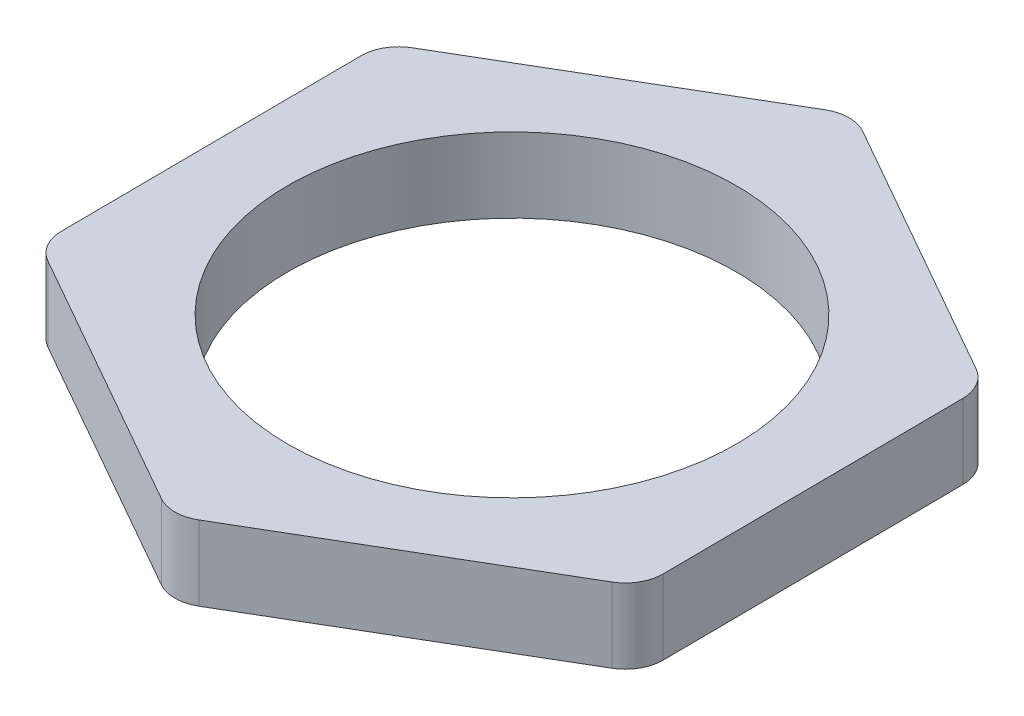
ISO-10303-21;
HEADER;
FILE_DESCRIPTION(('STEP AP214'),'2;1');
FILE_NAME('part.step','',(''),(''),'','','');
FILE_SCHEMA(('AUTOMOTIVE_DESIGN { 1 0 10303 214 1 1 1 1 }'));
ENDSEC;
DATA;
#1=APPLICATION_CONTEXT('core data for automotive mechanical design processes');
#2=APPLICATION_PROTOCOL_DEFINITION('international standard','automotive_design',2000,#1);
#3=PRODUCT_CONTEXT('',#1,'mechanical');
#4=PRODUCT('Part','Part','',(#3));
#5=PRODUCT_RELATED_PRODUCT_CATEGORY('part','',(#4));
#6=PRODUCT_DEFINITION_FORMATION('','',#4);
#7=PRODUCT_DEFINITION_CONTEXT('part definition',#1,'design');
#8=PRODUCT_DEFINITION('design','',#6,#7);
#9=PRODUCT_DEFINITION_SHAPE('','',#8);
#10=(LENGTH_UNIT() NAMED_UNIT(*) SI_UNIT(.MILLI.,.METRE.));
#11=(NAMED_UNIT(*) PLANE_ANGLE_UNIT() SI_UNIT($,.RADIAN.));
#12=(NAMED_UNIT(*) SI_UNIT($,.STERADIAN.) SOLID_ANGLE_UNIT());
#13=UNCERTAINTY_MEASURE_WITH_UNIT(LENGTH_MEASURE(1.E-05),#10,'distance_accuracy_value','');
#14=(GEOMETRIC_REPRESENTATION_CONTEXT(3) GLOBAL_UNCERTAINTY_ASSIGNED_CONTEXT((#13)) GLOBAL_UNIT_ASSIGNED_CONTEXT((#10,
#11,#12)) REPRESENTATION_CONTEXT('',''));
#15=CARTESIAN_POINT('',(0.,0.,0.));
#16=DIRECTION('',(0.,0.,1.));
#17=DIRECTION('',(1.,0.,0.));
#18=AXIS2_PLACEMENT_3D('',#15,#16,#17);
#19=CARTESIAN_POINT('',(0.,2.,0.));
#20=DIRECTION('',(0.,1.,0.));
#21=DIRECTION('',(0.,0.,1.));
#22=AXIS2_PLACEMENT_3D('',#19,#20,#21);
#23=PLANE('',#22);
#24=DIRECTION('',(-0.869622763385254,0.,-0.493716770428344));
#25=VECTOR('',#24,1.);
#26=CARTESIAN_POINT('',(7.96634965569797,2.,-4.67660202460014));
#27=LINE('',#26,#25);
#28=CARTESIAN_POINT('',(7.46427271916407,2.,-4.96164953491038));
#29=VERTEX_POINT('',#28);
#30=CARTESIAN_POINT('',(0.435195607689428,2.,-8.9523146792537));
#31=VERTEX_POINT('',#30);
#32=EDGE_CURVE('E245',#29,#31,#27,.T.);
#33=ORIENTED_EDGE('',*,*,#32,.T.);
#34=CARTESIAN_POINT('',(-0.0585211627389148,2.,-8.08269191586844));
#35=DIRECTION('',(0.,1.,0.));
#36=DIRECTION('',(0.,0.,1.));
#37=AXIS2_PLACEMENT_3D('',#34,#35,#36);
#38=CIRCLE('',#37,1.);
#39=CARTESIAN_POINT('',(-0.564778182325597,2.,-8.94507456302642));
#40=VERTEX_POINT('',#39);
#41=EDGE_CURVE('E191',#31,#40,#38,.T.);
#42=ORIENTED_EDGE('',*,*,#41,.T.);
#43=DIRECTION('',(-0.862382647157982,0.,0.506257019586683));
#44=VECTOR('',#43,1.);
#45=CARTESIAN_POINT('',(-0.0668813288444723,2.,-9.23736218956393));
#46=LINE('',#45,#44);
#47=CARTESIAN_POINT('',(-7.53533413106132,2.,-4.8530477915013));
#48=VERTEX_POINT('',#47);
#49=EDGE_CURVE('E147',#40,#48,#46,.T.);
#50=ORIENTED_EDGE('',*,*,#49,.T.);
#51=CARTESIAN_POINT('',(-7.02907711147464,2.,-3.99066514434332));
#52=DIRECTION('',(0.,1.,0.));
#53=DIRECTION('',(0.,0.,1.));
#54=AXIS2_PLACEMENT_3D('',#51,#52,#53);
#55=CIRCLE('',#54,1.);
#56=CARTESIAN_POINT('',(-8.02905090148967,2.,-3.98342502811604));
#57=VERTEX_POINT('',#56);
#58=EDGE_CURVE('E182',#48,#57,#55,.T.);
#59=ORIENTED_EDGE('',*,*,#58,.T.);
#60=DIRECTION('',(0.00724011622727172,0.,0.999973790015026));
#61=VECTOR('',#60,1.);
#62=CARTESIAN_POINT('',(-8.03323098454245,2.,-4.56076016496379));
#63=LINE('',#62,#61);
#64=CARTESIAN_POINT('',(-7.97052973875075,2.,4.09926688775239));
#65=VERTEX_POINT('',#64);
#66=EDGE_CURVE('E213',#57,#65,#63,.T.);
#67=ORIENTED_EDGE('',*,*,#66,.T.);
#68=CARTESIAN_POINT('',(-6.97055594873573,2.,4.09202677152512));
#69=DIRECTION('',(0.,1.,0.));
#70=DIRECTION('',(0.,0.,1.));
#71=AXIS2_PLACEMENT_3D('',#68,#69,#70);
#72=CIRCLE('',#71,1.);
#73=CARTESIAN_POINT('',(-7.46427271916407,2.,4.96164953491038));
#74=VERTEX_POINT('',#73);
#75=EDGE_CURVE('E184',#65,#74,#72,.T.);
#76=ORIENTED_EDGE('',*,*,#75,.T.);
#77=DIRECTION('',(0.869622763385254,0.,0.493716770428344));
#78=VECTOR('',#77,1.);
#79=CARTESIAN_POINT('',(-7.96634965569797,2.,4.67660202460014));
#80=LINE('',#79,#78);
#81=CARTESIAN_POINT('',(-0.43519560768943,2.,8.95231467925369));
#82=VERTEX_POINT('',#81);
#83=EDGE_CURVE('E225',#74,#82,#80,.T.);
#84=ORIENTED_EDGE('',*,*,#83,.T.);
#85=CARTESIAN_POINT('',(0.0585211627389158,2.,8.08269191586844));
#86=DIRECTION('',(0.,1.,0.));
#87=DIRECTION('',(0.,0.,1.));
#88=AXIS2_PLACEMENT_3D('',#85,#86,#87);
#89=CIRCLE('',#88,1.);
#90=CARTESIAN_POINT('',(0.564778182325598,2.,8.94507456302642));
#91=VERTEX_POINT('',#90);
#92=EDGE_CURVE('E59',#82,#91,#89,.T.);
#93=ORIENTED_EDGE('',*,*,#92,.T.);
#94=DIRECTION('',(0.862382647157983,0.,-0.506257019586682));
#95=VECTOR('',#94,1.);
#96=CARTESIAN_POINT('',(0.066881328844473,2.,9.23736218956393));
#97=LINE('',#96,#95);
#98=CARTESIAN_POINT('',(7.53533413106132,2.,4.8530477915013));
#99=VERTEX_POINT('',#98);
#100=EDGE_CURVE('E169',#91,#99,#97,.T.);
#101=ORIENTED_EDGE('',*,*,#100,.T.);
#102=CARTESIAN_POINT('',(7.02907711147464,2.,3.99066514434332));
#103=DIRECTION('',(0.,1.,0.));
#104=DIRECTION('',(0.,0.,1.));
#105=AXIS2_PLACEMENT_3D('',#102,#103,#104);
#106=CIRCLE('',#105,1.);
#107=CARTESIAN_POINT('',(8.02905090148967,2.,3.98342502811605));
#108=VERTEX_POINT('',#107);
#109=EDGE_CURVE('E187',#99,#108,#106,.T.);
#110=ORIENTED_EDGE('',*,*,#109,.T.);
#111=DIRECTION('',(-0.00724011622727171,0.,-0.999973790015026));
#112=VECTOR('',#111,1.);
#113=CARTESIAN_POINT('',(8.03323098454245,2.,4.56076016496379));
#114=LINE('',#113,#112);
#115=CARTESIAN_POINT('',(7.97052973875075,2.,-4.09926688775239));
#116=VERTEX_POINT('',#115);
#117=EDGE_CURVE('E168',#108,#116,#114,.T.);
#118=ORIENTED_EDGE('',*,*,#117,.T.);
#119=CARTESIAN_POINT('',(6.97055594873573,2.,-4.09202677152512));
#120=DIRECTION('',(0.,1.,0.));
#121=DIRECTION('',(0.,0.,1.));
#122=AXIS2_PLACEMENT_3D('',#119,#120,#121);
#123=CIRCLE('',#122,1.);
#124=EDGE_CURVE('E189',#116,#29,#123,.T.);
#125=ORIENTED_EDGE('',*,*,#124,.T.);
#126=EDGE_LOOP('',(#33,#42,#50,#59,#67,#76,#84,#93,#101,#110,#118,#125));
#127=FACE_BOUND('',#126,.T.);
#128=CARTESIAN_POINT('',(0.,2.,0.));
#129=DIRECTION('',(0.,1.,0.));
#130=DIRECTION('',(0.,0.,1.));
#131=AXIS2_PLACEMENT_3D('',#128,#129,#130);
#132=CIRCLE('',#131,6.);
#133=CARTESIAN_POINT('',(0.,2.,6.));
#134=VERTEX_POINT('',#133);
#135=EDGE_CURVE('E231',#134,#134,#132,.T.);
#136=ORIENTED_EDGE('',*,*,#135,.F.);
#137=EDGE_LOOP('',(#136));
#138=FACE_BOUND('',#137,.T.);
#139=ADVANCED_FACE('F37',(#127,#138),#23,.T.);
#140=CARTESIAN_POINT('',(0.,0.,0.));
#141=DIRECTION('',(0.,1.,0.));
#142=DIRECTION('',(0.,0.,1.));
#143=AXIS2_PLACEMENT_3D('',#140,#141,#142);
#144=PLANE('',#143);
#145=DIRECTION('',(-0.862382647157982,0.,0.506257019586683));
#146=VECTOR('',#145,1.);
#147=CARTESIAN_POINT('',(-0.0668813288444723,0.,-9.23736218956393));
#148=LINE('',#147,#146);
#149=CARTESIAN_POINT('',(-0.564778182325597,0.,-8.94507456302642));
#150=VERTEX_POINT('',#149);
#151=CARTESIAN_POINT('',(-7.53533413106132,0.,-4.8530477915013));
#152=VERTEX_POINT('',#151);
#153=EDGE_CURVE('E144',#150,#152,#148,.T.);
#154=ORIENTED_EDGE('',*,*,#153,.F.);
#155=CARTESIAN_POINT('',(-0.0585211627389148,0.,-8.08269191586844));
#156=DIRECTION('',(0.,1.,0.));
#157=DIRECTION('',(0.,0.,1.));
#158=AXIS2_PLACEMENT_3D('',#155,#156,#157);
#159=CIRCLE('',#158,1.);
#160=CARTESIAN_POINT('',(0.435195607689428,0.,-8.9523146792537));
#161=VERTEX_POINT('',#160);
#162=EDGE_CURVE('E127',#150,#161,#159,.F.);
#163=ORIENTED_EDGE('',*,*,#162,.T.);
#164=DIRECTION('',(-0.869622763385254,0.,-0.493716770428344));
#165=VECTOR('',#164,1.);
#166=CARTESIAN_POINT('',(7.96634965569797,0.,-4.67660202460014));
#167=LINE('',#166,#165);
#168=CARTESIAN_POINT('',(7.46427271916407,0.,-4.96164953491038));
#169=VERTEX_POINT('',#168);
#170=EDGE_CURVE('E155',#169,#161,#167,.T.);
#171=ORIENTED_EDGE('',*,*,#170,.F.);
#172=CARTESIAN_POINT('',(6.97055594873573,0.,-4.09202677152512));
#173=DIRECTION('',(0.,1.,0.));
#174=DIRECTION('',(0.,0.,1.));
#175=AXIS2_PLACEMENT_3D('',#172,#173,#174);
#176=CIRCLE('',#175,1.);
#177=CARTESIAN_POINT('',(7.97052973875075,0.,-4.09926688775239));
#178=VERTEX_POINT('',#177);
#179=EDGE_CURVE('E138',#169,#178,#176,.F.);
#180=ORIENTED_EDGE('',*,*,#179,.T.);
#181=DIRECTION('',(-0.00724011622727171,0.,-0.999973790015026));
#182=VECTOR('',#181,1.);
#183=CARTESIAN_POINT('',(8.03323098454245,0.,4.56076016496379));
#184=LINE('',#183,#182);
#185=CARTESIAN_POINT('',(8.02905090148967,0.,3.98342502811605));
#186=VERTEX_POINT('',#185);
#187=EDGE_CURVE('E160',#186,#178,#184,.T.);
#188=ORIENTED_EDGE('',*,*,#187,.F.);
#189=CARTESIAN_POINT('',(7.02907711147464,0.,3.99066514434332));
#190=DIRECTION('',(0.,1.,0.));
#191=DIRECTION('',(0.,0.,1.));
#192=AXIS2_PLACEMENT_3D('',#189,#190,#191);
#193=CIRCLE('',#192,1.);
#194=CARTESIAN_POINT('',(7.53533413106132,0.,4.8530477915013));
#195=VERTEX_POINT('',#194);
#196=EDGE_CURVE('E176',#186,#195,#193,.F.);
#197=ORIENTED_EDGE('',*,*,#196,.T.);
#198=DIRECTION('',(0.862382647157983,0.,-0.506257019586682));
#199=VECTOR('',#198,1.);
#200=CARTESIAN_POINT('',(0.066881328844473,0.,9.23736218956393));
#201=LINE('',#200,#199);
#202=CARTESIAN_POINT('',(0.564778182325598,0.,8.94507456302642));
#203=VERTEX_POINT('',#202);
#204=EDGE_CURVE('E166',#203,#195,#201,.T.);
#205=ORIENTED_EDGE('',*,*,#204,.F.);
#206=CARTESIAN_POINT('',(0.0585211627389158,0.,8.08269191586844));
#207=DIRECTION('',(0.,1.,0.));
#208=DIRECTION('',(0.,0.,1.));
#209=AXIS2_PLACEMENT_3D('',#206,#207,#208);
#210=CIRCLE('',#209,1.);
#211=CARTESIAN_POINT('',(-0.43519560768943,0.,8.95231467925369));
#212=VERTEX_POINT('',#211);
#213=EDGE_CURVE('E174',#203,#212,#210,.F.);
#214=ORIENTED_EDGE('',*,*,#213,.T.);
#215=DIRECTION('',(0.869622763385254,0.,0.493716770428344));
#216=VECTOR('',#215,1.);
#217=CARTESIAN_POINT('',(-7.96634965569797,0.,4.67660202460014));
#218=LINE('',#217,#216);
#219=CARTESIAN_POINT('',(-7.46427271916407,0.,4.96164953491038));
#220=VERTEX_POINT('',#219);
#221=EDGE_CURVE('E158',#220,#212,#218,.T.);
#222=ORIENTED_EDGE('',*,*,#221,.F.);
#223=CARTESIAN_POINT('',(-6.97055594873573,0.,4.09202677152512));
#224=DIRECTION('',(0.,1.,0.));
#225=DIRECTION('',(0.,0.,1.));
#226=AXIS2_PLACEMENT_3D('',#223,#224,#225);
#227=CIRCLE('',#226,1.);
#228=CARTESIAN_POINT('',(-7.97052973875075,0.,4.09926688775239));
#229=VERTEX_POINT('',#228);
#230=EDGE_CURVE('E172',#220,#229,#227,.F.);
#231=ORIENTED_EDGE('',*,*,#230,.T.);
#232=DIRECTION('',(0.00724011622727172,0.,0.999973790015026));
#233=VECTOR('',#232,1.);
#234=CARTESIAN_POINT('',(-8.03323098454245,0.,-4.56076016496379));
#235=LINE('',#234,#233);
#236=CARTESIAN_POINT('',(-8.02905090148967,0.,-3.98342502811604));
#237=VERTEX_POINT('',#236);
#238=EDGE_CURVE('E154',#237,#229,#235,.T.);
#239=ORIENTED_EDGE('',*,*,#238,.F.);
#240=CARTESIAN_POINT('',(-7.02907711147464,0.,-3.99066514434332));
#241=DIRECTION('',(0.,1.,0.));
#242=DIRECTION('',(0.,0.,1.));
#243=AXIS2_PLACEMENT_3D('',#240,#241,#242);
#244=CIRCLE('',#243,1.);
#245=EDGE_CURVE('E148',#237,#152,#244,.F.);
#246=ORIENTED_EDGE('',*,*,#245,.T.);
#247=EDGE_LOOP('',(#154,#163,#171,#180,#188,#197,#205,#214,#222,#231,#239,#246));
#248=FACE_BOUND('',#247,.T.);
#249=CARTESIAN_POINT('',(0.,0.,0.));
#250=DIRECTION('',(0.,1.,0.));
#251=DIRECTION('',(0.,0.,1.));
#252=AXIS2_PLACEMENT_3D('',#249,#250,#251);
#253=CIRCLE('',#252,6.);
#254=CARTESIAN_POINT('',(0.,0.,6.));
#255=VERTEX_POINT('',#254);
#256=EDGE_CURVE('E236',#255,#255,#253,.T.);
#257=ORIENTED_EDGE('',*,*,#256,.T.);
#258=EDGE_LOOP('',(#257));
#259=FACE_BOUND('',#258,.T.);
#260=ADVANCED_FACE('F151',(#248,#259),#144,.F.);
#261=CARTESIAN_POINT('',(8.03323098454245,2.,4.56076016496379));
#262=DIRECTION('',(-0.999973790015026,0.,0.00724011622727171));
#263=DIRECTION('',(0.00724011622727171,0.,0.999973790015026));
#264=AXIS2_PLACEMENT_3D('',#261,#262,#263);
#265=PLANE('',#264);
#266=ORIENTED_EDGE('',*,*,#187,.T.);
#267=DIRECTION('',(0.,-1.,0.));
#268=VECTOR('',#267,1.);
#269=CARTESIAN_POINT('',(7.97052973875075,2.,-4.09926688775239));
#270=LINE('',#269,#268);
#271=EDGE_CURVE('E196',#178,#116,#270,.F.);
#272=ORIENTED_EDGE('',*,*,#271,.T.);
#273=ORIENTED_EDGE('',*,*,#117,.F.);
#274=DIRECTION('',(0.,-1.,0.));
#275=VECTOR('',#274,1.);
#276=CARTESIAN_POINT('',(8.02905090148967,2.,3.98342502811605));
#277=LINE('',#276,#275);
#278=EDGE_CURVE('E193',#108,#186,#277,.T.);
#279=ORIENTED_EDGE('',*,*,#278,.T.);
#280=EDGE_LOOP('',(#266,#272,#273,#279));
#281=FACE_BOUND('',#280,.T.);
#282=ADVANCED_FACE('F258',(#281),#265,.F.);
#283=CARTESIAN_POINT('',(7.96634965569797,2.,-4.67660202460014));
#284=DIRECTION('',(-0.493716770428344,0.,0.869622763385254));
#285=DIRECTION('',(0.869622763385254,0.,0.493716770428344));
#286=AXIS2_PLACEMENT_3D('',#283,#284,#285);
#287=PLANE('',#286);
#288=ORIENTED_EDGE('',*,*,#170,.T.);
#289=DIRECTION('',(0.,-1.,0.));
#290=VECTOR('',#289,1.);
#291=CARTESIAN_POINT('',(0.43519560768943,2.,-8.9523146792537));
#292=LINE('',#291,#290);
#293=EDGE_CURVE('E132',#161,#31,#292,.F.);
#294=ORIENTED_EDGE('',*,*,#293,.T.);
#295=ORIENTED_EDGE('',*,*,#32,.F.);
#296=DIRECTION('',(0.,-1.,0.));
#297=VECTOR('',#296,1.);
#298=CARTESIAN_POINT('',(7.46427271916407,2.,-4.96164953491038));
#299=LINE('',#298,#297);
#300=EDGE_CURVE('E137',#29,#169,#299,.T.);
#301=ORIENTED_EDGE('',*,*,#300,.T.);
#302=EDGE_LOOP('',(#288,#294,#295,#301));
#303=FACE_BOUND('',#302,.T.);
#304=ADVANCED_FACE('F272',(#303),#287,.F.);
#305=CARTESIAN_POINT('',(-0.0668813288444723,2.,-9.23736218956393));
#306=DIRECTION('',(0.506257019586683,0.,0.862382647157982));
#307=DIRECTION('',(0.862382647157983,0.,-0.506257019586683));
#308=AXIS2_PLACEMENT_3D('',#305,#306,#307);
#309=PLANE('',#308);
#310=ORIENTED_EDGE('',*,*,#49,.F.);
#311=DIRECTION('',(0.,-1.,0.));
#312=VECTOR('',#311,1.);
#313=CARTESIAN_POINT('',(-0.564778182325597,2.,-8.94507456302642));
#314=LINE('',#313,#312);
#315=EDGE_CURVE('E131',#40,#150,#314,.T.);
#316=ORIENTED_EDGE('',*,*,#315,.T.);
#317=ORIENTED_EDGE('',*,*,#153,.T.);
#318=DIRECTION('',(0.,-1.,0.));
#319=VECTOR('',#318,1.);
#320=CARTESIAN_POINT('',(-7.53533413106132,2.,-4.8530477915013));
#321=LINE('',#320,#319);
#322=EDGE_CURVE('E149',#152,#48,#321,.F.);
#323=ORIENTED_EDGE('',*,*,#322,.T.);
#324=EDGE_LOOP('',(#310,#316,#317,#323));
#325=FACE_BOUND('',#324,.T.);
#326=ADVANCED_FACE('F143',(#325),#309,.F.);
#327=CARTESIAN_POINT('',(-8.03323098454245,2.,-4.56076016496379));
#328=DIRECTION('',(0.999973790015026,0.,-0.00724011622727172));
#329=DIRECTION('',(-0.00724011622727172,0.,-0.999973790015026));
#330=AXIS2_PLACEMENT_3D('',#327,#328,#329);
#331=PLANE('',#330);
#332=ORIENTED_EDGE('',*,*,#238,.T.);
#333=DIRECTION('',(0.,-1.,0.));
#334=VECTOR('',#333,1.);
#335=CARTESIAN_POINT('',(-7.97052973875075,2.,4.09926688775239));
#336=LINE('',#335,#334);
#337=EDGE_CURVE('E11',#229,#65,#336,.F.);
#338=ORIENTED_EDGE('',*,*,#337,.T.);
#339=ORIENTED_EDGE('',*,*,#66,.F.);
#340=DIRECTION('',(0.,-1.,0.));
#341=VECTOR('',#340,1.);
#342=CARTESIAN_POINT('',(-8.02905090148967,2.,-3.98342502811604));
#343=LINE('',#342,#341);
#344=EDGE_CURVE('E45',#57,#237,#343,.T.);
#345=ORIENTED_EDGE('',*,*,#344,.T.);
#346=EDGE_LOOP('',(#332,#338,#339,#345));
#347=FACE_BOUND('',#346,.T.);
#348=ADVANCED_FACE('F210',(#347),#331,.F.);
#349=CARTESIAN_POINT('',(-7.96634965569797,2.,4.67660202460014));
#350=DIRECTION('',(0.493716770428344,0.,-0.869622763385254));
#351=DIRECTION('',(-0.869622763385254,0.,-0.493716770428344));
#352=AXIS2_PLACEMENT_3D('',#349,#350,#351);
#353=PLANE('',#352);
#354=ORIENTED_EDGE('',*,*,#221,.T.);
#355=DIRECTION('',(0.,-1.,0.));
#356=VECTOR('',#355,1.);
#357=CARTESIAN_POINT('',(-0.435195607689428,2.,8.95231467925369));
#358=LINE('',#357,#356);
#359=EDGE_CURVE('E205',#212,#82,#358,.F.);
#360=ORIENTED_EDGE('',*,*,#359,.T.);
#361=ORIENTED_EDGE('',*,*,#83,.F.);
#362=DIRECTION('',(0.,-1.,0.));
#363=VECTOR('',#362,1.);
#364=CARTESIAN_POINT('',(-7.46427271916407,2.,4.96164953491038));
#365=LINE('',#364,#363);
#366=EDGE_CURVE('E202',#74,#220,#365,.T.);
#367=ORIENTED_EDGE('',*,*,#366,.T.);
#368=EDGE_LOOP('',(#354,#360,#361,#367));
#369=FACE_BOUND('',#368,.T.);
#370=ADVANCED_FACE('F223',(#369),#353,.F.);
#371=CARTESIAN_POINT('',(0.066881328844473,2.,9.23736218956393));
#372=DIRECTION('',(-0.506257019586682,0.,-0.862382647157983));
#373=DIRECTION('',(-0.862382647157983,0.,0.506257019586682));
#374=AXIS2_PLACEMENT_3D('',#371,#372,#373);
#375=PLANE('',#374);
#376=ORIENTED_EDGE('',*,*,#204,.T.);
#377=DIRECTION('',(0.,-1.,0.));
#378=VECTOR('',#377,1.);
#379=CARTESIAN_POINT('',(7.53533413106132,2.,4.8530477915013));
#380=LINE('',#379,#378);
#381=EDGE_CURVE('E52',#195,#99,#380,.F.);
#382=ORIENTED_EDGE('',*,*,#381,.T.);
#383=ORIENTED_EDGE('',*,*,#100,.F.);
#384=DIRECTION('',(0.,-1.,0.));
#385=VECTOR('',#384,1.);
#386=CARTESIAN_POINT('',(0.564778182325598,2.,8.94507456302642));
#387=LINE('',#386,#385);
#388=EDGE_CURVE('E198',#91,#203,#387,.T.);
#389=ORIENTED_EDGE('',*,*,#388,.T.);
#390=EDGE_LOOP('',(#376,#382,#383,#389));
#391=FACE_BOUND('',#390,.T.);
#392=ADVANCED_FACE('F263',(#391),#375,.F.);
#393=CARTESIAN_POINT('',(0.,2.,0.));
#394=DIRECTION('',(0.,-1.,0.));
#395=DIRECTION('',(0.,0.,-1.));
#396=AXIS2_PLACEMENT_3D('',#393,#394,#395);
#397=CYLINDRICAL_SURFACE('',#396,6.);
#398=ORIENTED_EDGE('',*,*,#135,.T.);
#399=EDGE_LOOP('',(#398));
#400=FACE_BOUND('',#399,.T.);
#401=ORIENTED_EDGE('',*,*,#256,.F.);
#402=EDGE_LOOP('',(#401));
#403=FACE_BOUND('',#402,.T.);
#404=ADVANCED_FACE('F261',(#400,#403),#397,.F.);
#405=CARTESIAN_POINT('',(-0.0585211627389148,2.,-8.08269191586844));
#406=DIRECTION('',(0.,-1.,0.));
#407=DIRECTION('',(0.,0.,-1.));
#408=AXIS2_PLACEMENT_3D('',#405,#406,#407);
#409=CYLINDRICAL_SURFACE('',#408,1.);
#410=ORIENTED_EDGE('',*,*,#41,.F.);
#411=ORIENTED_EDGE('',*,*,#293,.F.);
#412=ORIENTED_EDGE('',*,*,#162,.F.);
#413=ORIENTED_EDGE('',*,*,#315,.F.);
#414=EDGE_LOOP('',(#410,#411,#412,#413));
#415=FACE_BOUND('',#414,.T.);
#416=ADVANCED_FACE('F130',(#415),#409,.T.);
#417=CARTESIAN_POINT('',(6.97055594873573,2.,-4.09202677152512));
#418=DIRECTION('',(0.,-1.,0.));
#419=DIRECTION('',(0.,0.,-1.));
#420=AXIS2_PLACEMENT_3D('',#417,#418,#419);
#421=CYLINDRICAL_SURFACE('',#420,1.);
#422=ORIENTED_EDGE('',*,*,#124,.F.);
#423=ORIENTED_EDGE('',*,*,#271,.F.);
#424=ORIENTED_EDGE('',*,*,#179,.F.);
#425=ORIENTED_EDGE('',*,*,#300,.F.);
#426=EDGE_LOOP('',(#422,#423,#424,#425));
#427=FACE_BOUND('',#426,.T.);
#428=ADVANCED_FACE('F280',(#427),#421,.T.);
#429=CARTESIAN_POINT('',(7.02907711147464,2.,3.99066514434332));
#430=DIRECTION('',(0.,-1.,0.));
#431=DIRECTION('',(0.,0.,-1.));
#432=AXIS2_PLACEMENT_3D('',#429,#430,#431);
#433=CYLINDRICAL_SURFACE('',#432,1.);
#434=ORIENTED_EDGE('',*,*,#109,.F.);
#435=ORIENTED_EDGE('',*,*,#381,.F.);
#436=ORIENTED_EDGE('',*,*,#196,.F.);
#437=ORIENTED_EDGE('',*,*,#278,.F.);
#438=EDGE_LOOP('',(#434,#435,#436,#437));
#439=FACE_BOUND('',#438,.T.);
#440=ADVANCED_FACE('F283',(#439),#433,.T.);
#441=CARTESIAN_POINT('',(0.0585211627389158,2.,8.08269191586844));
#442=DIRECTION('',(0.,-1.,0.));
#443=DIRECTION('',(0.,0.,-1.));
#444=AXIS2_PLACEMENT_3D('',#441,#442,#443);
#445=CYLINDRICAL_SURFACE('',#444,1.);
#446=ORIENTED_EDGE('',*,*,#92,.F.);
#447=ORIENTED_EDGE('',*,*,#359,.F.);
#448=ORIENTED_EDGE('',*,*,#213,.F.);
#449=ORIENTED_EDGE('',*,*,#388,.F.);
#450=EDGE_LOOP('',(#446,#447,#448,#449));
#451=FACE_BOUND('',#450,.T.);
#452=ADVANCED_FACE('F252',(#451),#445,.T.);
#453=CARTESIAN_POINT('',(-6.97055594873573,2.,4.09202677152512));
#454=DIRECTION('',(0.,-1.,0.));
#455=DIRECTION('',(0.,0.,-1.));
#456=AXIS2_PLACEMENT_3D('',#453,#454,#455);
#457=CYLINDRICAL_SURFACE('',#456,1.);
#458=ORIENTED_EDGE('',*,*,#75,.F.);
#459=ORIENTED_EDGE('',*,*,#337,.F.);
#460=ORIENTED_EDGE('',*,*,#230,.F.);
#461=ORIENTED_EDGE('',*,*,#366,.F.);
#462=EDGE_LOOP('',(#458,#459,#460,#461));
#463=FACE_BOUND('',#462,.T.);
#464=ADVANCED_FACE('F220',(#463),#457,.T.);
#465=CARTESIAN_POINT('',(-7.02907711147464,2.,-3.99066514434332));
#466=DIRECTION('',(0.,-1.,0.));
#467=DIRECTION('',(0.,0.,-1.));
#468=AXIS2_PLACEMENT_3D('',#465,#466,#467);
#469=CYLINDRICAL_SURFACE('',#468,1.);
#470=ORIENTED_EDGE('',*,*,#58,.F.);
#471=ORIENTED_EDGE('',*,*,#322,.F.);
#472=ORIENTED_EDGE('',*,*,#245,.F.);
#473=ORIENTED_EDGE('',*,*,#344,.F.);
#474=EDGE_LOOP('',(#470,#471,#472,#473));
#475=FACE_BOUND('',#474,.T.);
#476=ADVANCED_FACE('F39',(#475),#469,.T.);
#477=CLOSED_SHELL('',(#139,#260,#282,#304,#326,#348,#370,#392,#404,#416,#428,#440,#452,#464,#476));
#478=MANIFOLD_SOLID_BREP('B2',#477);
#479=ADVANCED_BREP_SHAPE_REPRESENTATION('',(#18,#478),#14);
#480=SHAPE_DEFINITION_REPRESENTATION(#9,#479);
ENDSEC;
END-ISO-10303-21;
